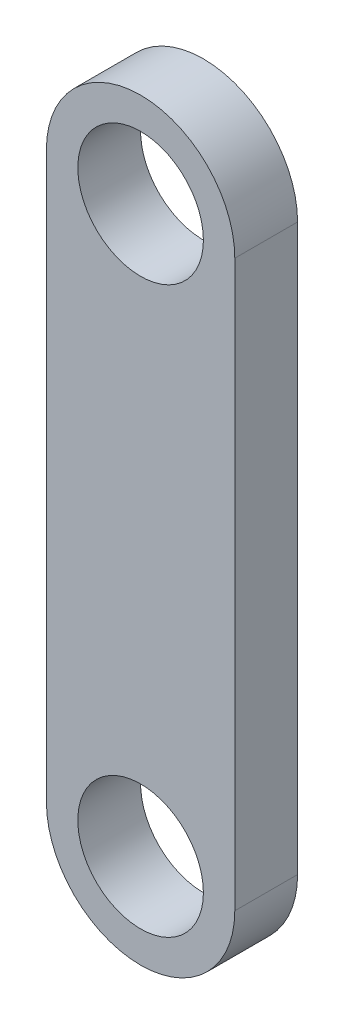
ISO-10303-21;
HEADER;
FILE_DESCRIPTION(('STEP AP214'),'2;1');
FILE_NAME('part.step','',(''),(''),'','','');
FILE_SCHEMA(('AUTOMOTIVE_DESIGN { 1 0 10303 214 1 1 1 1 }'));
ENDSEC;
DATA;
#1=APPLICATION_CONTEXT('core data for automotive mechanical design processes');
#2=APPLICATION_PROTOCOL_DEFINITION('international standard','automotive_design',2000,#1);
#3=PRODUCT_CONTEXT('',#1,'mechanical');
#4=PRODUCT('Part','Part','',(#3));
#5=PRODUCT_RELATED_PRODUCT_CATEGORY('part','',(#4));
#6=PRODUCT_DEFINITION_FORMATION('','',#4);
#7=PRODUCT_DEFINITION_CONTEXT('part definition',#1,'design');
#8=PRODUCT_DEFINITION('design','',#6,#7);
#9=PRODUCT_DEFINITION_SHAPE('','',#8);
#10=(LENGTH_UNIT() NAMED_UNIT(*) SI_UNIT(.MILLI.,.METRE.));
#11=(NAMED_UNIT(*) PLANE_ANGLE_UNIT() SI_UNIT($,.RADIAN.));
#12=(NAMED_UNIT(*) SI_UNIT($,.STERADIAN.) SOLID_ANGLE_UNIT());
#13=UNCERTAINTY_MEASURE_WITH_UNIT(LENGTH_MEASURE(1.E-05),#10,'distance_accuracy_value','');
#14=(GEOMETRIC_REPRESENTATION_CONTEXT(3) GLOBAL_UNCERTAINTY_ASSIGNED_CONTEXT((#13)) GLOBAL_UNIT_ASSIGNED_CONTEXT((#10,
#11,#12)) REPRESENTATION_CONTEXT('',''));
#15=CARTESIAN_POINT('',(0.,0.,0.));
#16=DIRECTION('',(0.,0.,1.));
#17=DIRECTION('',(1.,0.,0.));
#18=AXIS2_PLACEMENT_3D('',#15,#16,#17);
#19=CARTESIAN_POINT('',(64.9970516652697,40.7547615574328,0.75));
#20=DIRECTION('',(0.,0.,1.));
#21=DIRECTION('',(1.,0.,0.));
#22=AXIS2_PLACEMENT_3D('',#19,#20,#21);
#23=PLANE('',#22);
#24=CARTESIAN_POINT('',(64.9970516652697,40.7547615574328,0.75));
#25=DIRECTION('',(0.,0.,1.));
#26=DIRECTION('',(1.,0.,0.));
#27=AXIS2_PLACEMENT_3D('',#24,#25,#26);
#28=CIRCLE('',#27,1.5);
#29=CARTESIAN_POINT('',(66.4970516652697,40.7547615574328,0.75));
#30=VERTEX_POINT('',#29);
#31=EDGE_CURVE('E118',#30,#30,#28,.T.);
#32=ORIENTED_EDGE('',*,*,#31,.F.);
#33=EDGE_LOOP('',(#32));
#34=FACE_BOUND('',#33,.T.);
#35=CARTESIAN_POINT('',(64.9970516652697,40.7547615574328,0.75));
#36=DIRECTION('',(0.,0.,1.));
#37=DIRECTION('',(1.,0.,0.));
#38=AXIS2_PLACEMENT_3D('',#35,#36,#37);
#39=CIRCLE('',#38,2.25);
#40=CARTESIAN_POINT('',(67.2470516652697,40.7547615574328,0.75));
#41=VERTEX_POINT('',#40);
#42=CARTESIAN_POINT('',(62.7470516652697,40.7547615574328,0.75));
#43=VERTEX_POINT('',#42);
#44=EDGE_CURVE('E98',#41,#43,#39,.T.);
#45=ORIENTED_EDGE('',*,*,#44,.T.);
#46=DIRECTION('',(0.,-1.,0.));
#47=VECTOR('',#46,1.);
#48=CARTESIAN_POINT('',(62.7470516652697,40.7547615574328,0.75));
#49=LINE('',#48,#47);
#50=CARTESIAN_POINT('',(62.7470516652697,27.2547615574328,0.75));
#51=VERTEX_POINT('',#50);
#52=EDGE_CURVE('E93',#43,#51,#49,.T.);
#53=ORIENTED_EDGE('',*,*,#52,.T.);
#54=CARTESIAN_POINT('',(64.9970516652697,27.2547615574328,0.75));
#55=DIRECTION('',(0.,0.,1.));
#56=DIRECTION('',(1.,0.,0.));
#57=AXIS2_PLACEMENT_3D('',#54,#55,#56);
#58=CIRCLE('',#57,2.25);
#59=CARTESIAN_POINT('',(67.2470516652697,27.2547615574328,0.75));
#60=VERTEX_POINT('',#59);
#61=EDGE_CURVE('E96',#51,#60,#58,.T.);
#62=ORIENTED_EDGE('',*,*,#61,.T.);
#63=DIRECTION('',(0.,1.,0.));
#64=VECTOR('',#63,1.);
#65=CARTESIAN_POINT('',(67.2470516652697,40.7547615574328,0.75));
#66=LINE('',#65,#64);
#67=EDGE_CURVE('E63',#60,#41,#66,.T.);
#68=ORIENTED_EDGE('',*,*,#67,.T.);
#69=EDGE_LOOP('',(#45,#53,#62,#68));
#70=FACE_BOUND('',#69,.T.);
#71=CARTESIAN_POINT('',(64.9970516652697,27.2547615574328,0.75));
#72=DIRECTION('',(0.,0.,1.));
#73=DIRECTION('',(1.,0.,0.));
#74=AXIS2_PLACEMENT_3D('',#71,#72,#73);
#75=CIRCLE('',#74,1.5);
#76=CARTESIAN_POINT('',(66.4970516652697,27.2547615574328,0.75));
#77=VERTEX_POINT('',#76);
#78=EDGE_CURVE('E140',#77,#77,#75,.T.);
#79=ORIENTED_EDGE('',*,*,#78,.F.);
#80=EDGE_LOOP('',(#79));
#81=FACE_BOUND('',#80,.T.);
#82=ADVANCED_FACE('F45',(#34,#70,#81),#23,.T.);
#83=CARTESIAN_POINT('',(64.9970516652697,40.7547615574328,-0.75));
#84=DIRECTION('',(0.,0.,1.));
#85=DIRECTION('',(1.,0.,0.));
#86=AXIS2_PLACEMENT_3D('',#83,#84,#85);
#87=PLANE('',#86);
#88=CARTESIAN_POINT('',(64.9970516652697,40.7547615574328,-0.75));
#89=DIRECTION('',(0.,0.,1.));
#90=DIRECTION('',(1.,0.,0.));
#91=AXIS2_PLACEMENT_3D('',#88,#89,#90);
#92=CIRCLE('',#91,2.25);
#93=CARTESIAN_POINT('',(67.2470516652697,40.7547615574328,-0.75));
#94=VERTEX_POINT('',#93);
#95=CARTESIAN_POINT('',(62.7470516652697,40.7547615574328,-0.75));
#96=VERTEX_POINT('',#95);
#97=EDGE_CURVE('E114',#94,#96,#92,.T.);
#98=ORIENTED_EDGE('',*,*,#97,.F.);
#99=DIRECTION('',(0.,1.,0.));
#100=VECTOR('',#99,1.);
#101=CARTESIAN_POINT('',(67.2470516652697,40.7547615574328,-0.75));
#102=LINE('',#101,#100);
#103=CARTESIAN_POINT('',(67.2470516652697,27.2547615574328,-0.75));
#104=VERTEX_POINT('',#103);
#105=EDGE_CURVE('E86',#104,#94,#102,.T.);
#106=ORIENTED_EDGE('',*,*,#105,.F.);
#107=CARTESIAN_POINT('',(64.9970516652697,27.2547615574328,-0.75));
#108=DIRECTION('',(0.,0.,1.));
#109=DIRECTION('',(1.,0.,0.));
#110=AXIS2_PLACEMENT_3D('',#107,#108,#109);
#111=CIRCLE('',#110,2.25);
#112=CARTESIAN_POINT('',(62.7470516652697,27.2547615574328,-0.75));
#113=VERTEX_POINT('',#112);
#114=EDGE_CURVE('E80',#113,#104,#111,.T.);
#115=ORIENTED_EDGE('',*,*,#114,.F.);
#116=DIRECTION('',(0.,-1.,0.));
#117=VECTOR('',#116,1.);
#118=CARTESIAN_POINT('',(62.7470516652697,40.7547615574328,-0.75));
#119=LINE('',#118,#117);
#120=EDGE_CURVE('E103',#96,#113,#119,.T.);
#121=ORIENTED_EDGE('',*,*,#120,.F.);
#122=EDGE_LOOP('',(#98,#106,#115,#121));
#123=FACE_BOUND('',#122,.T.);
#124=CARTESIAN_POINT('',(64.9970516652697,40.7547615574328,-0.75));
#125=DIRECTION('',(0.,0.,1.));
#126=DIRECTION('',(1.,0.,0.));
#127=AXIS2_PLACEMENT_3D('',#124,#125,#126);
#128=CIRCLE('',#127,1.5);
#129=CARTESIAN_POINT('',(66.4970516652697,40.7547615574328,-0.75));
#130=VERTEX_POINT('',#129);
#131=EDGE_CURVE('E136',#130,#130,#128,.T.);
#132=ORIENTED_EDGE('',*,*,#131,.T.);
#133=EDGE_LOOP('',(#132));
#134=FACE_BOUND('',#133,.T.);
#135=CARTESIAN_POINT('',(64.9970516652697,27.2547615574328,-0.75));
#136=DIRECTION('',(0.,0.,1.));
#137=DIRECTION('',(1.,0.,0.));
#138=AXIS2_PLACEMENT_3D('',#135,#136,#137);
#139=CIRCLE('',#138,1.5);
#140=CARTESIAN_POINT('',(66.4970516652697,27.2547615574328,-0.75));
#141=VERTEX_POINT('',#140);
#142=EDGE_CURVE('E144',#141,#141,#139,.T.);
#143=ORIENTED_EDGE('',*,*,#142,.T.);
#144=EDGE_LOOP('',(#143));
#145=FACE_BOUND('',#144,.T.);
#146=ADVANCED_FACE('F131',(#123,#134,#145),#87,.F.);
#147=CARTESIAN_POINT('',(64.9970516652697,40.7547615574328,0.75));
#148=DIRECTION('',(0.,0.,-1.));
#149=DIRECTION('',(-1.,0.,0.));
#150=AXIS2_PLACEMENT_3D('',#147,#148,#149);
#151=CYLINDRICAL_SURFACE('',#150,2.25);
#152=ORIENTED_EDGE('',*,*,#97,.T.);
#153=DIRECTION('',(0.,0.,-1.));
#154=VECTOR('',#153,1.);
#155=CARTESIAN_POINT('',(62.7470516652697,40.7547615574328,0.75));
#156=LINE('',#155,#154);
#157=EDGE_CURVE('E11',#43,#96,#156,.T.);
#158=ORIENTED_EDGE('',*,*,#157,.F.);
#159=ORIENTED_EDGE('',*,*,#44,.F.);
#160=DIRECTION('',(0.,0.,-1.));
#161=VECTOR('',#160,1.);
#162=CARTESIAN_POINT('',(67.2470516652697,40.7547615574328,0.75));
#163=LINE('',#162,#161);
#164=EDGE_CURVE('E110',#41,#94,#163,.T.);
#165=ORIENTED_EDGE('',*,*,#164,.T.);
#166=EDGE_LOOP('',(#152,#158,#159,#165));
#167=FACE_BOUND('',#166,.T.);
#168=ADVANCED_FACE('F47',(#167),#151,.T.);
#169=CARTESIAN_POINT('',(62.7470516652697,40.7547615574328,0.75));
#170=DIRECTION('',(1.,0.,0.));
#171=DIRECTION('',(0.,0.,-1.));
#172=AXIS2_PLACEMENT_3D('',#169,#170,#171);
#173=PLANE('',#172);
#174=ORIENTED_EDGE('',*,*,#120,.T.);
#175=DIRECTION('',(0.,0.,-1.));
#176=VECTOR('',#175,1.);
#177=CARTESIAN_POINT('',(62.7470516652697,27.2547615574328,0.75));
#178=LINE('',#177,#176);
#179=EDGE_CURVE('E55',#51,#113,#178,.T.);
#180=ORIENTED_EDGE('',*,*,#179,.F.);
#181=ORIENTED_EDGE('',*,*,#52,.F.);
#182=ORIENTED_EDGE('',*,*,#157,.T.);
#183=EDGE_LOOP('',(#174,#180,#181,#182));
#184=FACE_BOUND('',#183,.T.);
#185=ADVANCED_FACE('F102',(#184),#173,.F.);
#186=CARTESIAN_POINT('',(64.9970516652697,27.2547615574328,0.75));
#187=DIRECTION('',(0.,0.,-1.));
#188=DIRECTION('',(-1.,0.,0.));
#189=AXIS2_PLACEMENT_3D('',#186,#187,#188);
#190=CYLINDRICAL_SURFACE('',#189,2.25);
#191=ORIENTED_EDGE('',*,*,#114,.T.);
#192=DIRECTION('',(0.,0.,-1.));
#193=VECTOR('',#192,1.);
#194=CARTESIAN_POINT('',(67.2470516652697,27.2547615574328,0.75));
#195=LINE('',#194,#193);
#196=EDGE_CURVE('E105',#60,#104,#195,.T.);
#197=ORIENTED_EDGE('',*,*,#196,.F.);
#198=ORIENTED_EDGE('',*,*,#61,.F.);
#199=ORIENTED_EDGE('',*,*,#179,.T.);
#200=EDGE_LOOP('',(#191,#197,#198,#199));
#201=FACE_BOUND('',#200,.T.);
#202=ADVANCED_FACE('F106',(#201),#190,.T.);
#203=CARTESIAN_POINT('',(67.2470516652697,40.7547615574328,0.75));
#204=DIRECTION('',(-1.,0.,0.));
#205=DIRECTION('',(0.,0.,1.));
#206=AXIS2_PLACEMENT_3D('',#203,#204,#205);
#207=PLANE('',#206);
#208=ORIENTED_EDGE('',*,*,#105,.T.);
#209=ORIENTED_EDGE('',*,*,#164,.F.);
#210=ORIENTED_EDGE('',*,*,#67,.F.);
#211=ORIENTED_EDGE('',*,*,#196,.T.);
#212=EDGE_LOOP('',(#208,#209,#210,#211));
#213=FACE_BOUND('',#212,.T.);
#214=ADVANCED_FACE('F128',(#213),#207,.F.);
#215=CARTESIAN_POINT('',(64.9970516652697,40.7547615574328,0.75));
#216=DIRECTION('',(0.,0.,-1.));
#217=DIRECTION('',(-1.,0.,0.));
#218=AXIS2_PLACEMENT_3D('',#215,#216,#217);
#219=CYLINDRICAL_SURFACE('',#218,1.5);
#220=ORIENTED_EDGE('',*,*,#31,.T.);
#221=EDGE_LOOP('',(#220));
#222=FACE_BOUND('',#221,.T.);
#223=ORIENTED_EDGE('',*,*,#131,.F.);
#224=EDGE_LOOP('',(#223));
#225=FACE_BOUND('',#224,.T.);
#226=ADVANCED_FACE('F163',(#222,#225),#219,.F.);
#227=CARTESIAN_POINT('',(64.9970516652697,27.2547615574328,0.75));
#228=DIRECTION('',(0.,0.,-1.));
#229=DIRECTION('',(-1.,0.,0.));
#230=AXIS2_PLACEMENT_3D('',#227,#228,#229);
#231=CYLINDRICAL_SURFACE('',#230,1.5);
#232=ORIENTED_EDGE('',*,*,#78,.T.);
#233=EDGE_LOOP('',(#232));
#234=FACE_BOUND('',#233,.T.);
#235=ORIENTED_EDGE('',*,*,#142,.F.);
#236=EDGE_LOOP('',(#235));
#237=FACE_BOUND('',#236,.T.);
#238=ADVANCED_FACE('F152',(#234,#237),#231,.F.);
#239=CLOSED_SHELL('',(#82,#146,#168,#185,#202,#214,#226,#238));
#240=MANIFOLD_SOLID_BREP('B2',#239);
#241=ADVANCED_BREP_SHAPE_REPRESENTATION('',(#18,#240),#14);
#242=SHAPE_DEFINITION_REPRESENTATION(#9,#241);
ENDSEC;
END-ISO-10303-21;
